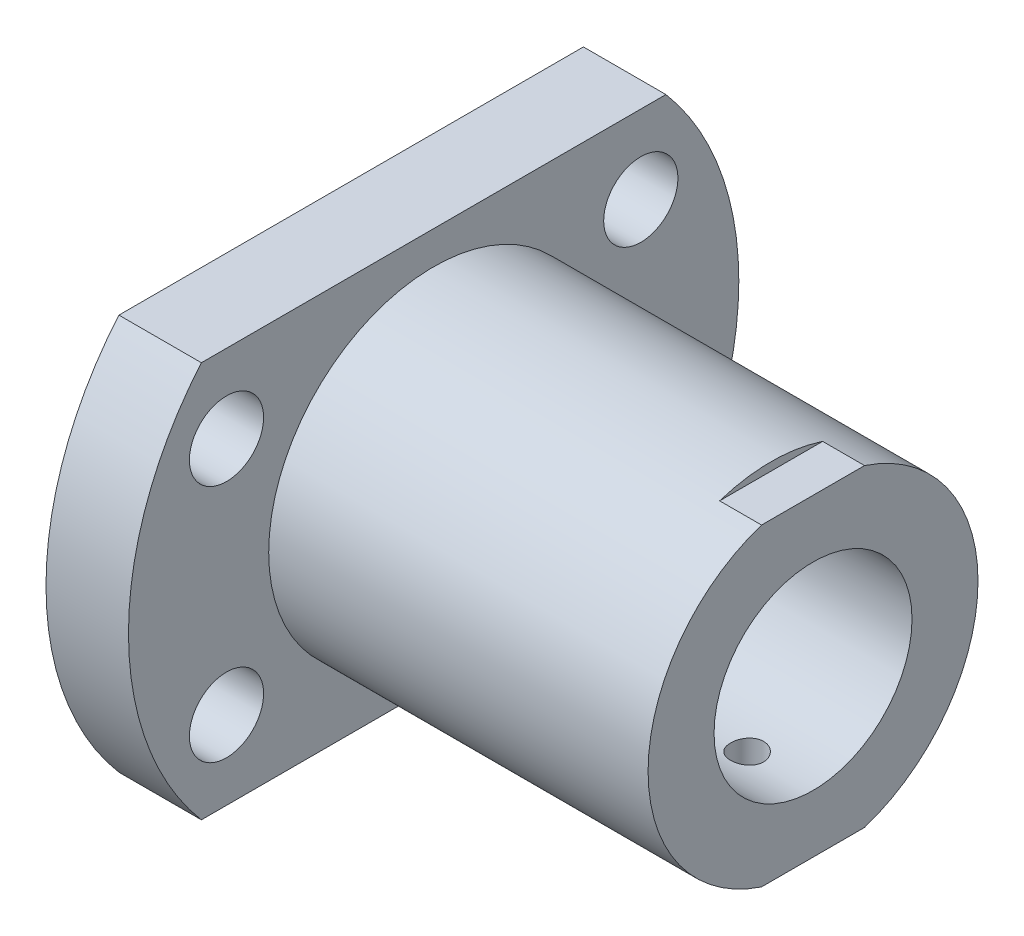
ISO-10303-21;
HEADER;
FILE_DESCRIPTION(('STEP AP214'),'2;1');
FILE_NAME('part.step','',(''),(''),'','','');
FILE_SCHEMA(('AUTOMOTIVE_DESIGN { 1 0 10303 214 1 1 1 1 }'));
ENDSEC;
DATA;
#1=APPLICATION_CONTEXT('core data for automotive mechanical design processes');
#2=APPLICATION_PROTOCOL_DEFINITION('international standard','automotive_design',2000,#1);
#3=PRODUCT_CONTEXT('',#1,'mechanical');
#4=PRODUCT('Part','Part','',(#3));
#5=PRODUCT_RELATED_PRODUCT_CATEGORY('part','',(#4));
#6=PRODUCT_DEFINITION_FORMATION('','',#4);
#7=PRODUCT_DEFINITION_CONTEXT('part definition',#1,'design');
#8=PRODUCT_DEFINITION('design','',#6,#7);
#9=PRODUCT_DEFINITION_SHAPE('','',#8);
#10=(LENGTH_UNIT() NAMED_UNIT(*) SI_UNIT(.MILLI.,.METRE.));
#11=(NAMED_UNIT(*) PLANE_ANGLE_UNIT() SI_UNIT($,.RADIAN.));
#12=(NAMED_UNIT(*) SI_UNIT($,.STERADIAN.) SOLID_ANGLE_UNIT());
#13=UNCERTAINTY_MEASURE_WITH_UNIT(LENGTH_MEASURE(1.E-05),#10,'distance_accuracy_value','');
#14=(GEOMETRIC_REPRESENTATION_CONTEXT(3) GLOBAL_UNCERTAINTY_ASSIGNED_CONTEXT((#13)) GLOBAL_UNIT_ASSIGNED_CONTEXT((#10,
#11,#12)) REPRESENTATION_CONTEXT('',''));
#15=CARTESIAN_POINT('',(0.,0.,0.));
#16=DIRECTION('',(0.,0.,1.));
#17=DIRECTION('',(1.,0.,0.));
#18=AXIS2_PLACEMENT_3D('',#15,#16,#17);
#19=CARTESIAN_POINT('',(0.,0.,0.));
#20=DIRECTION('',(1.,0.,0.));
#21=DIRECTION('',(0.,0.,-1.));
#22=AXIS2_PLACEMENT_3D('',#19,#20,#21);
#23=PLANE('',#22);
#24=DIRECTION('',(0.,0.,-1.));
#25=VECTOR('',#24,1.);
#26=CARTESIAN_POINT('',(0.,-12.,-14.0801278403287));
#27=LINE('',#26,#25);
#28=CARTESIAN_POINT('',(0.,-12.,14.0801278403287));
#29=VERTEX_POINT('',#28);
#30=CARTESIAN_POINT('',(0.,-12.,-14.0801278403287));
#31=VERTEX_POINT('',#30);
#32=EDGE_CURVE('E91',#29,#31,#27,.T.);
#33=ORIENTED_EDGE('',*,*,#32,.F.);
#34=CARTESIAN_POINT('',(0.,0.,0.));
#35=DIRECTION('',(-1.,0.,0.));
#36=DIRECTION('',(0.,0.,1.));
#37=AXIS2_PLACEMENT_3D('',#34,#35,#36);
#38=CIRCLE('',#37,18.5);
#39=CARTESIAN_POINT('',(0.,12.,14.0801278403287));
#40=VERTEX_POINT('',#39);
#41=EDGE_CURVE('E78',#40,#29,#38,.F.);
#42=ORIENTED_EDGE('',*,*,#41,.F.);
#43=DIRECTION('',(0.,0.,1.));
#44=VECTOR('',#43,1.);
#45=CARTESIAN_POINT('',(0.,12.,-14.0801278403287));
#46=LINE('',#45,#44);
#47=CARTESIAN_POINT('',(0.,12.,-14.0801278403287));
#48=VERTEX_POINT('',#47);
#49=EDGE_CURVE('E88',#48,#40,#46,.T.);
#50=ORIENTED_EDGE('',*,*,#49,.F.);
#51=CARTESIAN_POINT('',(0.,0.,0.));
#52=DIRECTION('',(-1.,0.,0.));
#53=DIRECTION('',(0.,0.,1.));
#54=AXIS2_PLACEMENT_3D('',#51,#52,#53);
#55=CIRCLE('',#54,18.5);
#56=EDGE_CURVE('E94',#31,#48,#55,.F.);
#57=ORIENTED_EDGE('',*,*,#56,.F.);
#58=EDGE_LOOP('',(#33,#42,#50,#57));
#59=FACE_BOUND('',#58,.T.);
#60=CARTESIAN_POINT('',(0.,0.,0.));
#61=DIRECTION('',(-1.,0.,0.));
#62=DIRECTION('',(0.,0.,1.));
#63=AXIS2_PLACEMENT_3D('',#60,#61,#62);
#64=CIRCLE('',#63,6.);
#65=CARTESIAN_POINT('',(0.,0.,6.));
#66=VERTEX_POINT('',#65);
#67=EDGE_CURVE('E170',#66,#66,#64,.F.);
#68=ORIENTED_EDGE('',*,*,#67,.T.);
#69=EDGE_LOOP('',(#68));
#70=FACE_BOUND('',#69,.T.);
#71=CARTESIAN_POINT('',(0.,7.25000000000001,-12.5573683548744));
#72=DIRECTION('',(-1.,0.,0.));
#73=DIRECTION('',(0.,0.,1.));
#74=AXIS2_PLACEMENT_3D('',#71,#72,#73);
#75=CIRCLE('',#74,2.25);
#76=CARTESIAN_POINT('',(0.,7.25000000000001,-10.3073683548744));
#77=VERTEX_POINT('',#76);
#78=EDGE_CURVE('E97',#77,#77,#75,.F.);
#79=ORIENTED_EDGE('',*,*,#78,.T.);
#80=EDGE_LOOP('',(#79));
#81=FACE_BOUND('',#80,.T.);
#82=CARTESIAN_POINT('',(0.,-7.25000000000002,-12.5573683548743));
#83=DIRECTION('',(-1.,0.,0.));
#84=DIRECTION('',(0.,0.,1.));
#85=AXIS2_PLACEMENT_3D('',#82,#83,#84);
#86=CIRCLE('',#85,2.25);
#87=CARTESIAN_POINT('',(0.,-7.25000000000002,-10.3073683548743));
#88=VERTEX_POINT('',#87);
#89=EDGE_CURVE('E177',#88,#88,#86,.F.);
#90=ORIENTED_EDGE('',*,*,#89,.T.);
#91=EDGE_LOOP('',(#90));
#92=FACE_BOUND('',#91,.T.);
#93=CARTESIAN_POINT('',(0.,-7.25000000000002,12.5573683548743));
#94=DIRECTION('',(-1.,0.,0.));
#95=DIRECTION('',(0.,0.,1.));
#96=AXIS2_PLACEMENT_3D('',#93,#94,#95);
#97=CIRCLE('',#96,2.25);
#98=CARTESIAN_POINT('',(0.,-7.25000000000002,14.8073683548744));
#99=VERTEX_POINT('',#98);
#100=EDGE_CURVE('E179',#99,#99,#97,.F.);
#101=ORIENTED_EDGE('',*,*,#100,.T.);
#102=EDGE_LOOP('',(#101));
#103=FACE_BOUND('',#102,.T.);
#104=CARTESIAN_POINT('',(0.,7.25000000000002,12.5573683548743));
#105=DIRECTION('',(-1.,0.,0.));
#106=DIRECTION('',(0.,0.,1.));
#107=AXIS2_PLACEMENT_3D('',#104,#105,#106);
#108=CIRCLE('',#107,2.25);
#109=CARTESIAN_POINT('',(0.,7.25000000000002,14.8073683548743));
#110=VERTEX_POINT('',#109);
#111=EDGE_CURVE('E20',#110,#110,#108,.F.);
#112=ORIENTED_EDGE('',*,*,#111,.T.);
#113=EDGE_LOOP('',(#112));
#114=FACE_BOUND('',#113,.T.);
#115=ADVANCED_FACE('F17',(#59,#70,#81,#92,#103,#114),#23,.F.);
#116=CARTESIAN_POINT('',(28.,7.25000000000002,12.5573683548743));
#117=DIRECTION('',(-1.,0.,0.));
#118=DIRECTION('',(0.,0.,1.));
#119=AXIS2_PLACEMENT_3D('',#116,#117,#118);
#120=CYLINDRICAL_SURFACE('',#119,2.25);
#121=CARTESIAN_POINT('',(5.,7.25000000000002,12.5573683548743));
#122=DIRECTION('',(-1.,0.,0.));
#123=DIRECTION('',(0.,0.,1.));
#124=AXIS2_PLACEMENT_3D('',#121,#122,#123);
#125=CIRCLE('',#124,2.25);
#126=CARTESIAN_POINT('',(5.,7.25000000000002,14.8073683548743));
#127=VERTEX_POINT('',#126);
#128=EDGE_CURVE('E385',#127,#127,#125,.F.);
#129=ORIENTED_EDGE('',*,*,#128,.T.);
#130=EDGE_LOOP('',(#129));
#131=FACE_BOUND('',#130,.T.);
#132=ORIENTED_EDGE('',*,*,#111,.F.);
#133=EDGE_LOOP('',(#132));
#134=FACE_BOUND('',#133,.T.);
#135=ADVANCED_FACE('F187',(#131,#134),#120,.F.);
#136=CARTESIAN_POINT('',(28.,-7.25000000000002,12.5573683548743));
#137=DIRECTION('',(-1.,0.,0.));
#138=DIRECTION('',(0.,0.,1.));
#139=AXIS2_PLACEMENT_3D('',#136,#137,#138);
#140=CYLINDRICAL_SURFACE('',#139,2.25);
#141=CARTESIAN_POINT('',(5.,-7.25000000000002,12.5573683548743));
#142=DIRECTION('',(-1.,0.,0.));
#143=DIRECTION('',(0.,0.,1.));
#144=AXIS2_PLACEMENT_3D('',#141,#142,#143);
#145=CIRCLE('',#144,2.25);
#146=CARTESIAN_POINT('',(5.,-7.25000000000002,14.8073683548744));
#147=VERTEX_POINT('',#146);
#148=EDGE_CURVE('E381',#147,#147,#145,.F.);
#149=ORIENTED_EDGE('',*,*,#148,.T.);
#150=EDGE_LOOP('',(#149));
#151=FACE_BOUND('',#150,.T.);
#152=ORIENTED_EDGE('',*,*,#100,.F.);
#153=EDGE_LOOP('',(#152));
#154=FACE_BOUND('',#153,.T.);
#155=ADVANCED_FACE('F189',(#151,#154),#140,.F.);
#156=CARTESIAN_POINT('',(28.,-7.25000000000002,-12.5573683548743));
#157=DIRECTION('',(-1.,0.,0.));
#158=DIRECTION('',(0.,0.,1.));
#159=AXIS2_PLACEMENT_3D('',#156,#157,#158);
#160=CYLINDRICAL_SURFACE('',#159,2.25);
#161=CARTESIAN_POINT('',(5.,-7.25000000000002,-12.5573683548743));
#162=DIRECTION('',(-1.,0.,0.));
#163=DIRECTION('',(0.,0.,1.));
#164=AXIS2_PLACEMENT_3D('',#161,#162,#163);
#165=CIRCLE('',#164,2.25);
#166=CARTESIAN_POINT('',(5.,-7.25000000000002,-10.3073683548743));
#167=VERTEX_POINT('',#166);
#168=EDGE_CURVE('E256',#167,#167,#165,.F.);
#169=ORIENTED_EDGE('',*,*,#168,.T.);
#170=EDGE_LOOP('',(#169));
#171=FACE_BOUND('',#170,.T.);
#172=ORIENTED_EDGE('',*,*,#89,.F.);
#173=EDGE_LOOP('',(#172));
#174=FACE_BOUND('',#173,.T.);
#175=ADVANCED_FACE('F196',(#171,#174),#160,.F.);
#176=CARTESIAN_POINT('',(28.,7.25000000000001,-12.5573683548744));
#177=DIRECTION('',(-1.,0.,0.));
#178=DIRECTION('',(0.,0.,1.));
#179=AXIS2_PLACEMENT_3D('',#176,#177,#178);
#180=CYLINDRICAL_SURFACE('',#179,2.25);
#181=CARTESIAN_POINT('',(5.,7.25000000000001,-12.5573683548744));
#182=DIRECTION('',(-1.,0.,0.));
#183=DIRECTION('',(0.,0.,1.));
#184=AXIS2_PLACEMENT_3D('',#181,#182,#183);
#185=CIRCLE('',#184,2.25);
#186=CARTESIAN_POINT('',(5.,7.25000000000001,-10.3073683548744));
#187=VERTEX_POINT('',#186);
#188=EDGE_CURVE('E253',#187,#187,#185,.F.);
#189=ORIENTED_EDGE('',*,*,#188,.T.);
#190=EDGE_LOOP('',(#189));
#191=FACE_BOUND('',#190,.T.);
#192=ORIENTED_EDGE('',*,*,#78,.F.);
#193=EDGE_LOOP('',(#192));
#194=FACE_BOUND('',#193,.T.);
#195=ADVANCED_FACE('F203',(#191,#194),#180,.F.);
#196=CARTESIAN_POINT('',(5.,-12.,-14.0801278403287));
#197=DIRECTION('',(0.,-1.,0.));
#198=DIRECTION('',(0.,0.,-1.));
#199=AXIS2_PLACEMENT_3D('',#196,#197,#198);
#200=PLANE('',#199);
#201=DIRECTION('',(0.,0.,1.));
#202=VECTOR('',#201,1.);
#203=CARTESIAN_POINT('',(5.,-12.,0.));
#204=LINE('',#203,#202);
#205=CARTESIAN_POINT('',(5.,-12.,-14.0801278403287));
#206=VERTEX_POINT('',#205);
#207=CARTESIAN_POINT('',(5.,-12.,14.0801278403287));
#208=VERTEX_POINT('',#207);
#209=EDGE_CURVE('E102',#206,#208,#204,.T.);
#210=ORIENTED_EDGE('',*,*,#209,.T.);
#211=DIRECTION('',(-1.,0.,0.));
#212=VECTOR('',#211,1.);
#213=CARTESIAN_POINT('',(5.,-12.,14.0801278403287));
#214=LINE('',#213,#212);
#215=EDGE_CURVE('E84',#29,#208,#214,.F.);
#216=ORIENTED_EDGE('',*,*,#215,.F.);
#217=ORIENTED_EDGE('',*,*,#32,.T.);
#218=DIRECTION('',(-1.,0.,0.));
#219=VECTOR('',#218,1.);
#220=CARTESIAN_POINT('',(5.,-12.,-14.0801278403287));
#221=LINE('',#220,#219);
#222=EDGE_CURVE('E246',#206,#31,#221,.T.);
#223=ORIENTED_EDGE('',*,*,#222,.F.);
#224=EDGE_LOOP('',(#210,#216,#217,#223));
#225=FACE_BOUND('',#224,.T.);
#226=ADVANCED_FACE('F100',(#225),#200,.T.);
#227=CARTESIAN_POINT('',(5.,0.,0.));
#228=DIRECTION('',(-1.,0.,0.));
#229=DIRECTION('',(0.,0.,1.));
#230=AXIS2_PLACEMENT_3D('',#227,#228,#229);
#231=CYLINDRICAL_SURFACE('',#230,18.5);
#232=DIRECTION('',(1.,0.,0.));
#233=VECTOR('',#232,1.);
#234=CARTESIAN_POINT('',(5.,12.,14.0801278403287));
#235=LINE('',#234,#233);
#236=CARTESIAN_POINT('',(5.,12.,14.0801278403287));
#237=VERTEX_POINT('',#236);
#238=EDGE_CURVE('E86',#40,#237,#235,.T.);
#239=ORIENTED_EDGE('',*,*,#238,.F.);
#240=ORIENTED_EDGE('',*,*,#41,.T.);
#241=ORIENTED_EDGE('',*,*,#215,.T.);
#242=CARTESIAN_POINT('',(5.,0.,0.));
#243=DIRECTION('',(-1.,0.,0.));
#244=DIRECTION('',(0.,0.,1.));
#245=AXIS2_PLACEMENT_3D('',#242,#243,#244);
#246=CIRCLE('',#245,18.5);
#247=EDGE_CURVE('E252',#208,#237,#246,.T.);
#248=ORIENTED_EDGE('',*,*,#247,.T.);
#249=EDGE_LOOP('',(#239,#240,#241,#248));
#250=FACE_BOUND('',#249,.T.);
#251=ADVANCED_FACE('F82',(#250),#231,.T.);
#252=CARTESIAN_POINT('',(5.,12.,-14.0801278403287));
#253=DIRECTION('',(0.,1.,0.));
#254=DIRECTION('',(0.,0.,1.));
#255=AXIS2_PLACEMENT_3D('',#252,#253,#254);
#256=PLANE('',#255);
#257=DIRECTION('',(0.,0.,1.));
#258=VECTOR('',#257,1.);
#259=CARTESIAN_POINT('',(5.,12.,0.));
#260=LINE('',#259,#258);
#261=CARTESIAN_POINT('',(5.,12.,-14.0801278403287));
#262=VERTEX_POINT('',#261);
#263=EDGE_CURVE('E241',#237,#262,#260,.F.);
#264=ORIENTED_EDGE('',*,*,#263,.T.);
#265=DIRECTION('',(-1.,0.,0.));
#266=VECTOR('',#265,1.);
#267=CARTESIAN_POINT('',(5.,12.,-14.0801278403287));
#268=LINE('',#267,#266);
#269=EDGE_CURVE('E173',#48,#262,#268,.F.);
#270=ORIENTED_EDGE('',*,*,#269,.F.);
#271=ORIENTED_EDGE('',*,*,#49,.T.);
#272=ORIENTED_EDGE('',*,*,#238,.T.);
#273=EDGE_LOOP('',(#264,#270,#271,#272));
#274=FACE_BOUND('',#273,.T.);
#275=ADVANCED_FACE('F212',(#274),#256,.T.);
#276=CARTESIAN_POINT('',(5.,0.,0.));
#277=DIRECTION('',(-1.,0.,0.));
#278=DIRECTION('',(0.,0.,1.));
#279=AXIS2_PLACEMENT_3D('',#276,#277,#278);
#280=CYLINDRICAL_SURFACE('',#279,18.5);
#281=CARTESIAN_POINT('',(5.,0.,0.));
#282=DIRECTION('',(-1.,0.,0.));
#283=DIRECTION('',(0.,0.,1.));
#284=AXIS2_PLACEMENT_3D('',#281,#282,#283);
#285=CIRCLE('',#284,18.5);
#286=EDGE_CURVE('E238',#262,#206,#285,.T.);
#287=ORIENTED_EDGE('',*,*,#286,.T.);
#288=ORIENTED_EDGE('',*,*,#222,.T.);
#289=ORIENTED_EDGE('',*,*,#56,.T.);
#290=ORIENTED_EDGE('',*,*,#269,.T.);
#291=EDGE_LOOP('',(#287,#288,#289,#290));
#292=FACE_BOUND('',#291,.T.);
#293=ADVANCED_FACE('F215',(#292),#280,.T.);
#294=CARTESIAN_POINT('',(25.46,-9.5,-18.5));
#295=DIRECTION('',(-1.,0.,0.));
#296=DIRECTION('',(0.,-1.,0.));
#297=AXIS2_PLACEMENT_3D('',#294,#295,#296);
#298=PLANE('',#297);
#299=CARTESIAN_POINT('',(25.46,0.,0.));
#300=DIRECTION('',(-1.,0.,0.));
#301=DIRECTION('',(0.,0.,1.));
#302=AXIS2_PLACEMENT_3D('',#299,#300,#301);
#303=CIRCLE('',#302,10.);
#304=CARTESIAN_POINT('',(25.46,-9.5,-3.12249899919921));
#305=VERTEX_POINT('',#304);
#306=CARTESIAN_POINT('',(25.46,-9.5,3.1224989991992));
#307=VERTEX_POINT('',#306);
#308=EDGE_CURVE('E132',#305,#307,#303,.T.);
#309=ORIENTED_EDGE('',*,*,#308,.F.);
#310=DIRECTION('',(0.,0.,1.));
#311=VECTOR('',#310,1.);
#312=CARTESIAN_POINT('',(25.46,-9.5,-18.5));
#313=LINE('',#312,#311);
#314=EDGE_CURVE('E171',#305,#307,#313,.T.);
#315=ORIENTED_EDGE('',*,*,#314,.T.);
#316=EDGE_LOOP('',(#309,#315));
#317=FACE_BOUND('',#316,.T.);
#318=ADVANCED_FACE('F218',(#317),#298,.F.);
#319=CARTESIAN_POINT('',(24.,-12.,0.));
#320=DIRECTION('',(0.,1.,0.));
#321=DIRECTION('',(0.,0.,1.));
#322=AXIS2_PLACEMENT_3D('',#319,#320,#321);
#323=CYLINDRICAL_SURFACE('',#322,0.999999999999998);
#324=CARTESIAN_POINT('',(24.,-5.91607978309962,0.999999999999998));
#325=CARTESIAN_POINT('',(24.0556957397448,-5.91608089760083,0.999997430362736));
#326=CARTESIAN_POINT('',(24.111462585772,-5.91687549623227,0.995327225125144));
#327=CARTESIAN_POINT('',(24.2214733672251,-5.91996725428782,0.976766506224319));
#328=CARTESIAN_POINT('',(24.2757139738488,-5.92226746704964,0.962857255219504));
#329=CARTESIAN_POINT('',(24.3810020750206,-5.92810282103682,0.926249422813517));
#330=CARTESIAN_POINT('',(24.4320535063324,-5.93163640278117,0.903561936766004));
#331=CARTESIAN_POINT('',(24.5296048620222,-5.9395382156152,0.850066639095232));
#332=CARTESIAN_POINT('',(24.5761064650155,-5.94390613711394,0.819261837886824));
#333=CARTESIAN_POINT('',(24.663723871425,-5.95303376602086,0.750075912978846));
#334=CARTESIAN_POINT('',(24.7047878920607,-5.95779662271406,0.711629612614948));
#335=CARTESIAN_POINT('',(24.7799155928021,-5.9671496849089,0.628391119356938));
#336=CARTESIAN_POINT('',(24.8139784963782,-5.9717398712127,0.583598223459331));
#337=CARTESIAN_POINT('',(24.8743259504081,-5.98026296666789,0.488608939901646));
#338=CARTESIAN_POINT('',(24.9005630285583,-5.98419180380442,0.438381996059988));
#339=CARTESIAN_POINT('',(24.9442085816065,-5.99091497211554,0.334157780528416));
#340=CARTESIAN_POINT('',(24.9616177068692,-5.99370938686122,0.280160786915633));
#341=CARTESIAN_POINT('',(24.9869570028593,-5.99782693717048,0.170457536268949));
#342=CARTESIAN_POINT('',(24.9949731532148,-5.99916341023759,0.114771647626945));
#343=CARTESIAN_POINT('',(25.0015663038603,-6.00026031774893,0.00283020778882272));
#344=CARTESIAN_POINT('',(25.000143930067,-6.00002085670142,-0.0534253053855523));
#345=CARTESIAN_POINT('',(24.9879674852323,-5.99800343784229,-0.164320648453425));
#346=CARTESIAN_POINT('',(24.9773060259492,-5.99624074921798,-0.218970964751015));
#347=CARTESIAN_POINT('',(24.9470997266195,-5.99139194038926,-0.325696364455005));
#348=CARTESIAN_POINT('',(24.9275545434525,-5.98830576906758,-0.377771348306927));
#349=CARTESIAN_POINT('',(24.8800428392956,-5.98113065499251,-0.478144400660145));
#350=CARTESIAN_POINT('',(24.8520378864421,-5.97703715210988,-0.526423938030248));
#351=CARTESIAN_POINT('',(24.7884320570964,-5.96830259348044,-0.617629541642158));
#352=CARTESIAN_POINT('',(24.7528311514854,-5.96366153563462,-0.660555587360561));
#353=CARTESIAN_POINT('',(24.6745373682105,-5.95428211061504,-0.740379653882565));
#354=CARTESIAN_POINT('',(24.6317648343995,-5.9495432433298,-0.777199520036934));
#355=CARTESIAN_POINT('',(24.5405857257885,-5.9405537217856,-0.84316900713159));
#356=CARTESIAN_POINT('',(24.4921766297695,-5.93630328770353,-0.872315176491827));
#357=CARTESIAN_POINT('',(24.3909947392696,-5.92877116046283,-0.922122995219524));
#358=CARTESIAN_POINT('',(24.3382137479271,-5.92549134225201,-0.942768253004033));
#359=CARTESIAN_POINT('',(24.2299355600204,-5.92030089070035,-0.974836086298936));
#360=CARTESIAN_POINT('',(24.1744443666015,-5.91838736593836,-0.986278144632044));
#361=CARTESIAN_POINT('',(24.0987926780435,-5.91687159118963,-0.99530574898543));
#362=CARTESIAN_POINT('',(24.0790789007515,-5.91657531838753,-0.99706467292526));
#363=CARTESIAN_POINT('',(24.0395797428412,-5.91617921619692,-0.999412255641839));
#364=CARTESIAN_POINT('',(24.0197943621517,-5.91607938700397,-1.00000091325352));
#365=CARTESIAN_POINT('',(23.9443042602552,-5.91608089760085,-0.999997430362737));
#366=CARTESIAN_POINT('',(23.888537414228,-5.91687549623227,-0.995327225125145));
#367=CARTESIAN_POINT('',(23.7785266327749,-5.91996725428781,-0.976766506224319));
#368=CARTESIAN_POINT('',(23.7242860261512,-5.92226746704963,-0.962857255219503));
#369=CARTESIAN_POINT('',(23.6189979249794,-5.92810282103682,-0.926249422813517));
#370=CARTESIAN_POINT('',(23.5679464936676,-5.93163640278117,-0.903561936766004));
#371=CARTESIAN_POINT('',(23.4703951379778,-5.9395382156152,-0.850066639095232));
#372=CARTESIAN_POINT('',(23.4238935349845,-5.94390613711394,-0.819261837886824));
#373=CARTESIAN_POINT('',(23.336276128575,-5.95303376602086,-0.750075912978846));
#374=CARTESIAN_POINT('',(23.2952121079393,-5.95779662271406,-0.711629612614948));
#375=CARTESIAN_POINT('',(23.2200844071979,-5.9671496849089,-0.628391119356938));
#376=CARTESIAN_POINT('',(23.1860215036218,-5.9717398712127,-0.583598223459332));
#377=CARTESIAN_POINT('',(23.1256740495919,-5.98026296666789,-0.488608939901646));
#378=CARTESIAN_POINT('',(23.0994369714417,-5.98419180380442,-0.438381996059987));
#379=CARTESIAN_POINT('',(23.0557914183935,-5.99091497211554,-0.334157780528415));
#380=CARTESIAN_POINT('',(23.0383822931308,-5.99370938686122,-0.280160786915632));
#381=CARTESIAN_POINT('',(23.0130429971407,-5.99782693717048,-0.170457536268949));
#382=CARTESIAN_POINT('',(23.0050268467852,-5.99916341023759,-0.114771647626945));
#383=CARTESIAN_POINT('',(22.9984336961397,-6.00026031774893,-0.00283020778882227));
#384=CARTESIAN_POINT('',(22.999856069933,-6.00002085670142,0.0534253053855525));
#385=CARTESIAN_POINT('',(23.0120325147677,-5.99800343784229,0.164320648453425));
#386=CARTESIAN_POINT('',(23.0226939740508,-5.99624074921798,0.218970964751014));
#387=CARTESIAN_POINT('',(23.0529002733805,-5.99139194038926,0.325696364455005));
#388=CARTESIAN_POINT('',(23.0724454565475,-5.98830576906758,0.377771348306927));
#389=CARTESIAN_POINT('',(23.1199571607044,-5.98113065499251,0.478144400660145));
#390=CARTESIAN_POINT('',(23.1479621135579,-5.97703715210988,0.526423938030248));
#391=CARTESIAN_POINT('',(23.2115679429036,-5.96830259348044,0.617629541642158));
#392=CARTESIAN_POINT('',(23.2471688485146,-5.96366153563462,0.66055558736056));
#393=CARTESIAN_POINT('',(23.3254626317895,-5.95428211061504,0.740379653882565));
#394=CARTESIAN_POINT('',(23.3682351656005,-5.9495432433298,0.777199520036934));
#395=CARTESIAN_POINT('',(23.4594142742115,-5.9405537217856,0.84316900713159));
#396=CARTESIAN_POINT('',(23.5078233702305,-5.93630328770353,0.872315176491827));
#397=CARTESIAN_POINT('',(23.6090052607304,-5.92877116046283,0.922122995219525));
#398=CARTESIAN_POINT('',(23.6617862520729,-5.92549134225201,0.942768253004034));
#399=CARTESIAN_POINT('',(23.7700644399796,-5.92030089070035,0.974836086298937));
#400=CARTESIAN_POINT('',(23.8255556333985,-5.91838736593835,0.986278144632044));
#401=CARTESIAN_POINT('',(23.9012073219565,-5.91687159118963,0.99530574898543));
#402=CARTESIAN_POINT('',(23.9209210992485,-5.91657531838754,0.99706467292526));
#403=CARTESIAN_POINT('',(23.9604202571588,-5.91617921619692,0.999412255641839));
#404=CARTESIAN_POINT('',(23.9802056378483,-5.91607938700396,1.00000091325352));
#405=CARTESIAN_POINT('',(24.,-5.91607978309962,0.999999999999998));
#406=B_SPLINE_CURVE_WITH_KNOTS('',3,(#324,#325,#326,#327,#328,#329,#330,#331,#332,#333,#334,
#335,#336,#337,#338,#339,#340,#341,#342,#343,#344,#345,#346,#347,#348,#349,#350,#351,#352,#353,
#354,#355,#356,#357,#358,#359,#360,#361,#362,#363,#364,#365,#366,#367,#368,#369,#370,#371,#372,
#373,#374,#375,#376,#377,#378,#379,#380,#381,#382,#383,#384,#385,#386,#387,#388,#389,#390,#391,
#392,#393,#394,#395,#396,#397,#398,#399,#400,#401,#402,#403,#404,#405),.UNSPECIFIED.,.T.,.F.,(4,
2,2,2,2,2,2,2,2,2,2,2,2,2,2,2,2,2,2,2,2,2,2,2,2,2,2,2,2,2,2,2,2,2,2,2,2,2,2,2,4),(0.,
0.167011630447707,0.334363008938283,0.501503549060948,0.668582189907185,0.837152287302727,
1.00574107159065,1.17533265406039,1.34491174072134,1.51292613069496,1.68092937888666,
1.84726780553137,2.01361265729293,2.18072486086639,2.34783770506956,2.51694730622927,
2.68613284236423,2.85564309389017,3.02479354716663,3.08414971014389,3.14350593221353,
3.31051756266124,3.47786894115182,3.64500948127448,3.81208812212072,3.98065821951626,
4.14924700380418,4.31883858627392,4.48841767293487,4.6564320629085,4.82443531110019,
4.99077373774491,5.15711858950646,5.32423079307992,5.4913436372831,5.6604532384428,
5.82963877457777,5.9991490261037,6.16829947938017,6.22765564235743,6.28701186442707),.UNSPECIFIED.);
#407=CARTESIAN_POINT('',(24.,-5.91607978309962,0.999999999999998));
#408=VERTEX_POINT('',#407);
#409=EDGE_CURVE('E164',#408,#408,#406,.T.);
#410=ORIENTED_EDGE('',*,*,#409,.T.);
#411=EDGE_LOOP('',(#410));
#412=FACE_BOUND('',#411,.T.);
#413=CARTESIAN_POINT('',(24.0000000000002,-9.9498743710662,-0.999999999999998));
#414=CARTESIAN_POINT('',(23.9440143824036,-9.94987541116602,-0.999995487044237));
#415=CARTESIAN_POINT('',(23.8879816523878,-9.95035218509344,-0.995281068962152));
#416=CARTESIAN_POINT('',(23.7774178898694,-9.95220939516237,-0.976530932220181));
#417=CARTESIAN_POINT('',(23.722890264858,-9.95359173043279,-0.962475623092603));
#418=CARTESIAN_POINT('',(23.6170282681463,-9.95710156588807,-0.925457761180735));
#419=CARTESIAN_POINT('',(23.5656908001442,-9.95922832981091,-0.902504006819697));
#420=CARTESIAN_POINT('',(23.467620980052,-9.96398642377636,-0.848356891592336));
#421=CARTESIAN_POINT('',(23.4208866318968,-9.96661753364665,-0.817167123924152));
#422=CARTESIAN_POINT('',(23.3331498477305,-9.97209920165961,-0.74730561120681));
#423=CARTESIAN_POINT('',(23.2921670052553,-9.97495046098913,-0.708609311434814));
#424=CARTESIAN_POINT('',(23.217264042001,-9.98054491761493,-0.624883919580161));
#425=CARTESIAN_POINT('',(23.1833445891061,-9.98328810467248,-0.579854229312739));
#426=CARTESIAN_POINT('',(23.1234686128998,-9.98836384290785,-0.484626150976342));
#427=CARTESIAN_POINT('',(23.0975287744923,-9.99069552938326,-0.434417222039378));
#428=CARTESIAN_POINT('',(23.0544554162661,-9.99467818320868,-0.330329513034761));
#429=CARTESIAN_POINT('',(23.0373216049423,-9.99632917309136,-0.276450854512712));
#430=CARTESIAN_POINT('',(23.0124021018674,-9.99875966462905,-0.166744831538025));
#431=CARTESIAN_POINT('',(23.004585180925,-9.99954207705163,-0.110924626245308));
#432=CARTESIAN_POINT('',(22.9984247281265,-10.0001571562716,0.00124064081207929));
#433=CARTESIAN_POINT('',(23.0000809673991,-9.9999898460142,0.0575856898636982));
#434=CARTESIAN_POINT('',(23.0127944430196,-9.99872671597691,0.168988591051384));
#435=CARTESIAN_POINT('',(23.0238180123982,-9.99763422143475,0.224050328288993));
#436=CARTESIAN_POINT('',(23.0549009483937,-9.99464730999639,0.331538700026734));
#437=CARTESIAN_POINT('',(23.0749605145647,-9.9927528753899,0.383965276302607));
#438=CARTESIAN_POINT('',(23.1235837600771,-9.98836928375468,0.484802402633364));
#439=CARTESIAN_POINT('',(23.1521626272465,-9.98587906616928,0.53320558119521));
#440=CARTESIAN_POINT('',(23.216999568827,-9.9805836136559,0.624537074702208));
#441=CARTESIAN_POINT('',(23.2532572340215,-9.97777839551861,0.667465681201588));
#442=CARTESIAN_POINT('',(23.3326049022721,-9.97215358179341,0.74682359550679));
#443=CARTESIAN_POINT('',(23.3757228706156,-9.96933397517684,0.783224944555354));
#444=CARTESIAN_POINT('',(23.4674948721236,-9.96400857429251,0.848294227667594));
#445=CARTESIAN_POINT('',(23.5161514573557,-9.96150292581564,0.876958576023993));
#446=CARTESIAN_POINT('',(23.6176584994678,-9.95708852009593,0.925737964187005));
#447=CARTESIAN_POINT('',(23.6705132317065,-9.95518038138156,0.945844152464097));
#448=CARTESIAN_POINT('',(23.7787850994923,-9.95218690590292,0.976843473662424));
#449=CARTESIAN_POINT('',(23.8341965331201,-9.95109982399909,0.98775615293496));
#450=CARTESIAN_POINT('',(23.9265821166601,-9.95007764862546,0.997979904737807));
#451=CARTESIAN_POINT('',(23.9632809253796,-9.94987368889988,1.00000295989518));
#452=CARTESIAN_POINT('',(24.0559856175966,-9.94987541116602,0.999995487044227));
#453=CARTESIAN_POINT('',(24.1120183476124,-9.95035218509344,0.995281068962131));
#454=CARTESIAN_POINT('',(24.2225821101308,-9.95220939516238,0.97653093222014));
#455=CARTESIAN_POINT('',(24.2771097351421,-9.95359173043279,0.962475623092552));
#456=CARTESIAN_POINT('',(24.3829717318539,-9.95710156588808,0.925457761180665));
#457=CARTESIAN_POINT('',(24.434309199856,-9.95922832981092,0.902504006819617));
#458=CARTESIAN_POINT('',(24.5323790199481,-9.96398642377637,0.848356891592238));
#459=CARTESIAN_POINT('',(24.5791133681033,-9.96661753364666,0.817167123924045));
#460=CARTESIAN_POINT('',(24.6668501522697,-9.97209920165962,0.747305611206686));
#461=CARTESIAN_POINT('',(24.7078329947448,-9.97495046098914,0.708609311434682));
#462=CARTESIAN_POINT('',(24.7827359579991,-9.98054491761494,0.624883919580016));
#463=CARTESIAN_POINT('',(24.816655410894,-9.98328810467249,0.579854229312589));
#464=CARTESIAN_POINT('',(24.8765313871003,-9.98836384290786,0.484626150976182));
#465=CARTESIAN_POINT('',(24.9024712255078,-9.99069552938327,0.434417222039213));
#466=CARTESIAN_POINT('',(24.9455445837339,-9.99467818320868,0.330329513034588));
#467=CARTESIAN_POINT('',(24.9626783950577,-9.99632917309137,0.276450854512535));
#468=CARTESIAN_POINT('',(24.9875978981327,-9.99875966462905,0.166744831537843));
#469=CARTESIAN_POINT('',(24.995414819075,-9.99954207705163,0.110924626245124));
#470=CARTESIAN_POINT('',(25.0015752718735,-10.0001571562716,-0.00124064081226414));
#471=CARTESIAN_POINT('',(24.9999190326009,-9.9999898460142,-0.0575856898638826));
#472=CARTESIAN_POINT('',(24.9872055569804,-9.9987267159769,-0.168988591051567));
#473=CARTESIAN_POINT('',(24.9761819876018,-9.99763422143475,-0.224050328289174));
#474=CARTESIAN_POINT('',(24.9450990516063,-9.99464730999638,-0.33153870002691));
#475=CARTESIAN_POINT('',(24.9250394854352,-9.9927528753899,-0.383965276302778));
#476=CARTESIAN_POINT('',(24.8764162399228,-9.98836928375467,-0.484802402633525));
#477=CARTESIAN_POINT('',(24.8478373727534,-9.98587906616927,-0.533205581195365));
#478=CARTESIAN_POINT('',(24.7830004311729,-9.9805836136559,-0.624537074702352));
#479=CARTESIAN_POINT('',(24.7467427659784,-9.9777783955186,-0.667465681201725));
#480=CARTESIAN_POINT('',(24.6673950977278,-9.97215358179341,-0.746823595506912));
#481=CARTESIAN_POINT('',(24.6242771293843,-9.96933397517683,-0.783224944555467));
#482=CARTESIAN_POINT('',(24.5325051278763,-9.9640085742925,-0.848294227667691));
#483=CARTESIAN_POINT('',(24.4838485426442,-9.96150292581564,-0.876958576024082));
#484=CARTESIAN_POINT('',(24.3823415005321,-9.95708852009592,-0.925737964187076));
#485=CARTESIAN_POINT('',(24.3294867682933,-9.95518038138155,-0.945844152464158));
#486=CARTESIAN_POINT('',(24.2212149005075,-9.95218690590291,-0.976843473662466));
#487=CARTESIAN_POINT('',(24.1658034668797,-9.95109982399908,-0.987756152934991));
#488=CARTESIAN_POINT('',(24.0734178833398,-9.95007764862546,-0.997979904737807));
#489=CARTESIAN_POINT('',(24.0367190746204,-9.94987368889988,-1.00000295989517));
#490=CARTESIAN_POINT('',(24.0000000000002,-9.9498743710662,-0.999999999999998));
#491=B_SPLINE_CURVE_WITH_KNOTS('',3,(#413,#414,#415,#416,#417,#418,#419,#420,#421,#422,#423,
#424,#425,#426,#427,#428,#429,#430,#431,#432,#433,#434,#435,#436,#437,#438,#439,#440,#441,#442,
#443,#444,#445,#446,#447,#448,#449,#450,#451,#452,#453,#454,#455,#456,#457,#458,#459,#460,#461,
#462,#463,#464,#465,#466,#467,#468,#469,#470,#471,#472,#473,#474,#475,#476,#477,#478,#479,#480,
#481,#482,#483,#484,#485,#486,#487,#488,#489,#490),.UNSPECIFIED.,.T.,.F.,(4,2,2,2,2,2,2,2,2,2,2,
2,2,2,2,2,2,2,2,2,2,2,2,2,2,2,2,2,2,2,2,2,2,2,2,2,2,2,4),(0.,0.167840014169936,
0.336033151479989,0.504060408633106,0.672014479823637,0.840527505557248,1.00905645794191,
1.17793543608176,1.34680882347593,1.51511455955108,1.68341622937995,1.85111555494092,
2.01881858421528,2.18682239335913,2.35481725153956,2.52351534776468,2.6922914932784,
2.86124177881491,3.02983194548323,3.13991253884194,3.30775255301188,3.47594569032193,
3.64397294747505,3.81192701866558,3.98044004439919,4.14896899678385,4.3178479749237,
4.48672136231787,4.65502709839303,4.82332876822189,4.99102809378286,5.15873112305722,
5.32673493220107,5.4947297903815,5.66342788660662,5.83220403212034,6.00115431765685,
6.16974448432518,6.27982507768352),.UNSPECIFIED.);
#492=CARTESIAN_POINT('',(24.0000000000002,-9.9498743710662,-0.999999999999998));
#493=VERTEX_POINT('',#492);
#494=EDGE_CURVE('E124',#493,#493,#491,.T.);
#495=ORIENTED_EDGE('',*,*,#494,.F.);
#496=EDGE_LOOP('',(#495));
#497=FACE_BOUND('',#496,.T.);
#498=ADVANCED_FACE('F134',(#412,#497),#323,.F.);
#499=CARTESIAN_POINT('',(25.46,-9.5,-18.5));
#500=DIRECTION('',(0.,1.,0.));
#501=DIRECTION('',(-1.,0.,0.));
#502=AXIS2_PLACEMENT_3D('',#499,#500,#501);
#503=PLANE('',#502);
#504=DIRECTION('',(-1.,0.,0.));
#505=VECTOR('',#504,1.);
#506=CARTESIAN_POINT('',(28.,-9.5,3.1224989991992));
#507=LINE('',#506,#505);
#508=CARTESIAN_POINT('',(28.,-9.5,3.1224989991992));
#509=VERTEX_POINT('',#508);
#510=EDGE_CURVE('E131',#307,#509,#507,.F.);
#511=ORIENTED_EDGE('',*,*,#510,.F.);
#512=ORIENTED_EDGE('',*,*,#314,.F.);
#513=DIRECTION('',(-1.,0.,0.));
#514=VECTOR('',#513,1.);
#515=CARTESIAN_POINT('',(28.,-9.5,-3.1224989991992));
#516=LINE('',#515,#514);
#517=CARTESIAN_POINT('',(28.,-9.5,-3.1224989991992));
#518=VERTEX_POINT('',#517);
#519=EDGE_CURVE('E232',#518,#305,#516,.T.);
#520=ORIENTED_EDGE('',*,*,#519,.F.);
#521=DIRECTION('',(0.,0.,-1.));
#522=VECTOR('',#521,1.);
#523=CARTESIAN_POINT('',(28.,-9.5,0.));
#524=LINE('',#523,#522);
#525=EDGE_CURVE('E123',#509,#518,#524,.T.);
#526=ORIENTED_EDGE('',*,*,#525,.F.);
#527=EDGE_LOOP('',(#511,#512,#520,#526));
#528=FACE_BOUND('',#527,.T.);
#529=ADVANCED_FACE('F161',(#528),#503,.F.);
#530=CARTESIAN_POINT('',(28.,0.,0.));
#531=DIRECTION('',(-1.,0.,0.));
#532=DIRECTION('',(0.,0.,1.));
#533=AXIS2_PLACEMENT_3D('',#530,#531,#532);
#534=CYLINDRICAL_SURFACE('',#533,6.);
#535=CARTESIAN_POINT('',(28.,0.,0.));
#536=DIRECTION('',(-1.,0.,0.));
#537=DIRECTION('',(0.,0.,1.));
#538=AXIS2_PLACEMENT_3D('',#535,#536,#537);
#539=CIRCLE('',#538,6.);
#540=CARTESIAN_POINT('',(28.,0.,6.));
#541=VERTEX_POINT('',#540);
#542=EDGE_CURVE('E120',#541,#541,#539,.T.);
#543=ORIENTED_EDGE('',*,*,#542,.F.);
#544=EDGE_LOOP('',(#543));
#545=FACE_BOUND('',#544,.T.);
#546=ORIENTED_EDGE('',*,*,#67,.F.);
#547=EDGE_LOOP('',(#546));
#548=FACE_BOUND('',#547,.T.);
#549=ORIENTED_EDGE('',*,*,#409,.F.);
#550=EDGE_LOOP('',(#549));
#551=FACE_BOUND('',#550,.T.);
#552=ADVANCED_FACE('F157',(#545,#548,#551),#534,.F.);
#553=CARTESIAN_POINT('',(5.,0.,0.));
#554=DIRECTION('',(-1.,0.,0.));
#555=DIRECTION('',(0.,0.,1.));
#556=AXIS2_PLACEMENT_3D('',#553,#554,#555);
#557=PLANE('',#556);
#558=ORIENTED_EDGE('',*,*,#263,.F.);
#559=ORIENTED_EDGE('',*,*,#247,.F.);
#560=ORIENTED_EDGE('',*,*,#209,.F.);
#561=ORIENTED_EDGE('',*,*,#286,.F.);
#562=EDGE_LOOP('',(#558,#559,#560,#561));
#563=FACE_BOUND('',#562,.T.);
#564=CARTESIAN_POINT('',(5.,0.,0.));
#565=DIRECTION('',(-1.,0.,0.));
#566=DIRECTION('',(0.,0.,1.));
#567=AXIS2_PLACEMENT_3D('',#564,#565,#566);
#568=CIRCLE('',#567,10.);
#569=CARTESIAN_POINT('',(5.,0.,10.));
#570=VERTEX_POINT('',#569);
#571=EDGE_CURVE('E114',#570,#570,#568,.F.);
#572=ORIENTED_EDGE('',*,*,#571,.F.);
#573=EDGE_LOOP('',(#572));
#574=FACE_BOUND('',#573,.T.);
#575=ORIENTED_EDGE('',*,*,#188,.F.);
#576=EDGE_LOOP('',(#575));
#577=FACE_BOUND('',#576,.T.);
#578=ORIENTED_EDGE('',*,*,#168,.F.);
#579=EDGE_LOOP('',(#578));
#580=FACE_BOUND('',#579,.T.);
#581=ORIENTED_EDGE('',*,*,#148,.F.);
#582=EDGE_LOOP('',(#581));
#583=FACE_BOUND('',#582,.T.);
#584=ORIENTED_EDGE('',*,*,#128,.F.);
#585=EDGE_LOOP('',(#584));
#586=FACE_BOUND('',#585,.T.);
#587=ADVANCED_FACE('F153',(#563,#574,#577,#580,#583,#586),#557,.F.);
#588=CARTESIAN_POINT('',(28.,0.,0.));
#589=DIRECTION('',(1.,0.,0.));
#590=DIRECTION('',(0.,0.,-1.));
#591=AXIS2_PLACEMENT_3D('',#588,#589,#590);
#592=PLANE('',#591);
#593=ORIENTED_EDGE('',*,*,#542,.T.);
#594=EDGE_LOOP('',(#593));
#595=FACE_BOUND('',#594,.T.);
#596=CARTESIAN_POINT('',(28.,0.,0.));
#597=DIRECTION('',(-1.,0.,0.));
#598=DIRECTION('',(0.,0.,1.));
#599=AXIS2_PLACEMENT_3D('',#596,#597,#598);
#600=CIRCLE('',#599,10.);
#601=CARTESIAN_POINT('',(28.,9.5,3.1224989991992));
#602=VERTEX_POINT('',#601);
#603=EDGE_CURVE('E111',#509,#602,#600,.T.);
#604=ORIENTED_EDGE('',*,*,#603,.F.);
#605=ORIENTED_EDGE('',*,*,#525,.T.);
#606=CARTESIAN_POINT('',(28.,0.,0.));
#607=DIRECTION('',(-1.,0.,0.));
#608=DIRECTION('',(0.,0.,1.));
#609=AXIS2_PLACEMENT_3D('',#606,#607,#608);
#610=CIRCLE('',#609,10.);
#611=CARTESIAN_POINT('',(28.,9.5,-3.1224989991992));
#612=VERTEX_POINT('',#611);
#613=EDGE_CURVE('E117',#612,#518,#610,.T.);
#614=ORIENTED_EDGE('',*,*,#613,.F.);
#615=DIRECTION('',(0.,0.,1.));
#616=VECTOR('',#615,1.);
#617=CARTESIAN_POINT('',(28.,9.5,-18.5));
#618=LINE('',#617,#616);
#619=EDGE_CURVE('E119',#612,#602,#618,.T.);
#620=ORIENTED_EDGE('',*,*,#619,.T.);
#621=EDGE_LOOP('',(#604,#605,#614,#620));
#622=FACE_BOUND('',#621,.T.);
#623=ADVANCED_FACE('F150',(#595,#622),#592,.T.);
#624=CARTESIAN_POINT('',(25.46,51.8319736668733,-18.5));
#625=DIRECTION('',(-1.,0.,0.));
#626=DIRECTION('',(0.,-1.,0.));
#627=AXIS2_PLACEMENT_3D('',#624,#625,#626);
#628=PLANE('',#627);
#629=CARTESIAN_POINT('',(25.46,0.,0.));
#630=DIRECTION('',(-1.,0.,0.));
#631=DIRECTION('',(0.,0.,1.));
#632=AXIS2_PLACEMENT_3D('',#629,#630,#631);
#633=CIRCLE('',#632,10.);
#634=CARTESIAN_POINT('',(25.46,9.5,3.1224989991992));
#635=VERTEX_POINT('',#634);
#636=CARTESIAN_POINT('',(25.46,9.5,-3.1224989991992));
#637=VERTEX_POINT('',#636);
#638=EDGE_CURVE('E26',#635,#637,#633,.T.);
#639=ORIENTED_EDGE('',*,*,#638,.F.);
#640=DIRECTION('',(0.,0.,1.));
#641=VECTOR('',#640,1.);
#642=CARTESIAN_POINT('',(25.46,9.5,-18.5));
#643=LINE('',#642,#641);
#644=EDGE_CURVE('E34',#635,#637,#643,.F.);
#645=ORIENTED_EDGE('',*,*,#644,.T.);
#646=EDGE_LOOP('',(#639,#645));
#647=FACE_BOUND('',#646,.T.);
#648=ADVANCED_FACE('F146',(#647),#628,.F.);
#649=CARTESIAN_POINT('',(25.46,9.5,-18.5));
#650=DIRECTION('',(0.,-1.,0.));
#651=DIRECTION('',(1.,0.,0.));
#652=AXIS2_PLACEMENT_3D('',#649,#650,#651);
#653=PLANE('',#652);
#654=DIRECTION('',(-1.,0.,0.));
#655=VECTOR('',#654,1.);
#656=CARTESIAN_POINT('',(28.,9.5,-3.1224989991992));
#657=LINE('',#656,#655);
#658=EDGE_CURVE('E11',#637,#612,#657,.F.);
#659=ORIENTED_EDGE('',*,*,#658,.F.);
#660=ORIENTED_EDGE('',*,*,#644,.F.);
#661=DIRECTION('',(-1.,0.,0.));
#662=VECTOR('',#661,1.);
#663=CARTESIAN_POINT('',(28.,9.5,3.1224989991992));
#664=LINE('',#663,#662);
#665=EDGE_CURVE('E110',#602,#635,#664,.T.);
#666=ORIENTED_EDGE('',*,*,#665,.F.);
#667=ORIENTED_EDGE('',*,*,#619,.F.);
#668=EDGE_LOOP('',(#659,#660,#666,#667));
#669=FACE_BOUND('',#668,.T.);
#670=ADVANCED_FACE('F142',(#669),#653,.F.);
#671=CARTESIAN_POINT('',(28.,0.,0.));
#672=DIRECTION('',(-1.,0.,0.));
#673=DIRECTION('',(0.,0.,1.));
#674=AXIS2_PLACEMENT_3D('',#671,#672,#673);
#675=CYLINDRICAL_SURFACE('',#674,10.);
#676=ORIENTED_EDGE('',*,*,#571,.T.);
#677=EDGE_LOOP('',(#676));
#678=FACE_BOUND('',#677,.T.);
#679=ORIENTED_EDGE('',*,*,#638,.T.);
#680=ORIENTED_EDGE('',*,*,#658,.T.);
#681=ORIENTED_EDGE('',*,*,#613,.T.);
#682=ORIENTED_EDGE('',*,*,#519,.T.);
#683=ORIENTED_EDGE('',*,*,#308,.T.);
#684=ORIENTED_EDGE('',*,*,#510,.T.);
#685=ORIENTED_EDGE('',*,*,#603,.T.);
#686=ORIENTED_EDGE('',*,*,#665,.T.);
#687=EDGE_LOOP('',(#679,#680,#681,#682,#683,#684,#685,#686));
#688=FACE_BOUND('',#687,.T.);
#689=ORIENTED_EDGE('',*,*,#494,.T.);
#690=EDGE_LOOP('',(#689));
#691=FACE_BOUND('',#690,.T.);
#692=ADVANCED_FACE('F138',(#678,#688,#691),#675,.T.);
#693=CLOSED_SHELL('',(#115,#135,#155,#175,#195,#226,#251,#275,#293,#318,#498,#529,#552,#587,
#623,#648,#670,#692));
#694=MANIFOLD_SOLID_BREP('B1',#693);
#695=ADVANCED_BREP_SHAPE_REPRESENTATION('',(#18,#694),#14);
#696=SHAPE_DEFINITION_REPRESENTATION(#9,#695);
ENDSEC;
END-ISO-10303-21;
